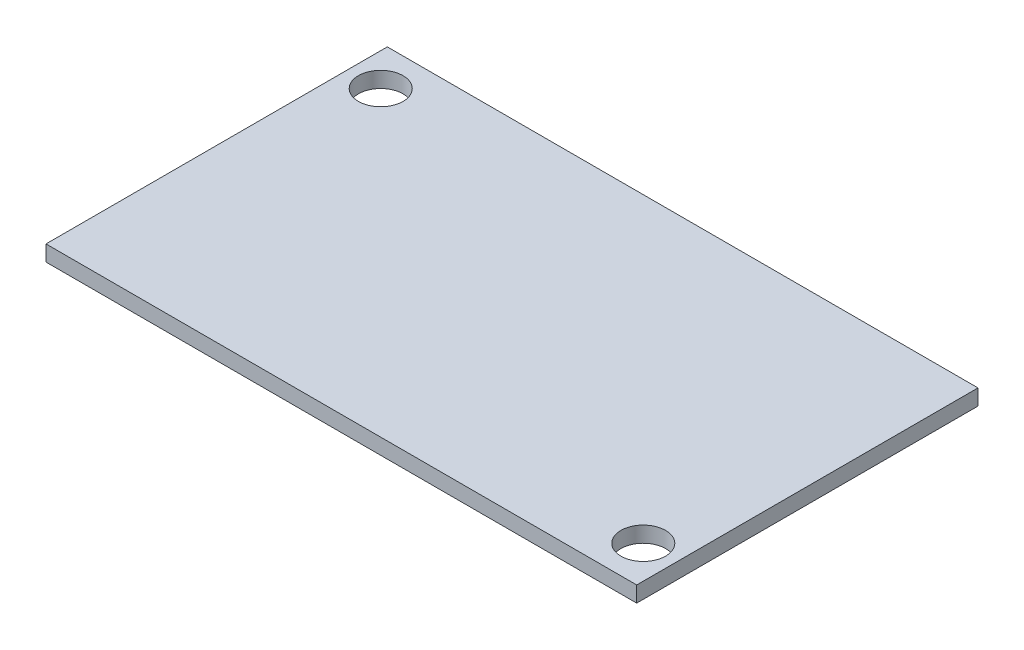
ISO-10303-21;
HEADER;
FILE_DESCRIPTION(('STEP AP214'),'2;1');
FILE_NAME('part.step','',(''),(''),'','','');
FILE_SCHEMA(('AUTOMOTIVE_DESIGN { 1 0 10303 214 1 1 1 1 }'));
ENDSEC;
DATA;
#1=APPLICATION_CONTEXT('core data for automotive mechanical design processes');
#2=APPLICATION_PROTOCOL_DEFINITION('international standard','automotive_design',2000,#1);
#3=PRODUCT_CONTEXT('',#1,'mechanical');
#4=PRODUCT('Part','Part','',(#3));
#5=PRODUCT_RELATED_PRODUCT_CATEGORY('part','',(#4));
#6=PRODUCT_DEFINITION_FORMATION('','',#4);
#7=PRODUCT_DEFINITION_CONTEXT('part definition',#1,'design');
#8=PRODUCT_DEFINITION('design','',#6,#7);
#9=PRODUCT_DEFINITION_SHAPE('','',#8);
#10=(LENGTH_UNIT() NAMED_UNIT(*) SI_UNIT(.MILLI.,.METRE.));
#11=(NAMED_UNIT(*) PLANE_ANGLE_UNIT() SI_UNIT($,.RADIAN.));
#12=(NAMED_UNIT(*) SI_UNIT($,.STERADIAN.) SOLID_ANGLE_UNIT());
#13=UNCERTAINTY_MEASURE_WITH_UNIT(LENGTH_MEASURE(1.E-05),#10,'distance_accuracy_value','');
#14=(GEOMETRIC_REPRESENTATION_CONTEXT(3) GLOBAL_UNCERTAINTY_ASSIGNED_CONTEXT((#13)) GLOBAL_UNIT_ASSIGNED_CONTEXT((#10,
#11,#12)) REPRESENTATION_CONTEXT('',''));
#15=CARTESIAN_POINT('',(0.,0.,0.));
#16=DIRECTION('',(0.,0.,1.));
#17=DIRECTION('',(1.,0.,0.));
#18=AXIS2_PLACEMENT_3D('',#15,#16,#17);
#19=CARTESIAN_POINT('',(-24.7774917250496,1.2,-1.35864833937372));
#20=DIRECTION('',(1.,0.,0.));
#21=DIRECTION('',(0.,0.,-1.));
#22=AXIS2_PLACEMENT_3D('',#19,#20,#21);
#23=PLANE('',#22);
#24=DIRECTION('',(0.,0.,1.));
#25=VECTOR('',#24,1.);
#26=CARTESIAN_POINT('',(-24.7774917250496,0.,-1.35864833937372));
#27=LINE('',#26,#25);
#28=CARTESIAN_POINT('',(-24.7774917250496,0.,-1.35864833937372));
#29=VERTEX_POINT('',#28);
#30=CARTESIAN_POINT('',(-24.7774917250496,0.,24.6413516606263));
#31=VERTEX_POINT('',#30);
#32=EDGE_CURVE('E95',#29,#31,#27,.T.);
#33=ORIENTED_EDGE('',*,*,#32,.T.);
#34=DIRECTION('',(0.,-1.,0.));
#35=VECTOR('',#34,1.);
#36=CARTESIAN_POINT('',(-24.7774917250496,1.2,24.6413516606263));
#37=LINE('',#36,#35);
#38=CARTESIAN_POINT('',(-24.7774917250496,1.2,24.6413516606263));
#39=VERTEX_POINT('',#38);
#40=EDGE_CURVE('E11',#39,#31,#37,.T.);
#41=ORIENTED_EDGE('',*,*,#40,.F.);
#42=DIRECTION('',(0.,0.,1.));
#43=VECTOR('',#42,1.);
#44=CARTESIAN_POINT('',(-24.7774917250496,1.2,-1.35864833937372));
#45=LINE('',#44,#43);
#46=CARTESIAN_POINT('',(-24.7774917250496,1.2,-1.35864833937372));
#47=VERTEX_POINT('',#46);
#48=EDGE_CURVE('E83',#47,#39,#45,.T.);
#49=ORIENTED_EDGE('',*,*,#48,.F.);
#50=DIRECTION('',(0.,-1.,0.));
#51=VECTOR('',#50,1.);
#52=CARTESIAN_POINT('',(-24.7774917250496,1.2,-1.35864833937372));
#53=LINE('',#52,#51);
#54=EDGE_CURVE('E91',#47,#29,#53,.T.);
#55=ORIENTED_EDGE('',*,*,#54,.T.);
#56=EDGE_LOOP('',(#33,#41,#49,#55));
#57=FACE_BOUND('',#56,.T.);
#58=ADVANCED_FACE('F32',(#57),#23,.F.);
#59=CARTESIAN_POINT('',(-24.7774917250496,1.2,24.6413516606263));
#60=DIRECTION('',(0.,0.,-1.));
#61=DIRECTION('',(-1.,0.,0.));
#62=AXIS2_PLACEMENT_3D('',#59,#60,#61);
#63=PLANE('',#62);
#64=DIRECTION('',(1.,0.,0.));
#65=VECTOR('',#64,1.);
#66=CARTESIAN_POINT('',(-24.7774917250496,0.,24.6413516606263));
#67=LINE('',#66,#65);
#68=CARTESIAN_POINT('',(20.2225082749504,0.,24.6413516606263));
#69=VERTEX_POINT('',#68);
#70=EDGE_CURVE('E87',#31,#69,#67,.T.);
#71=ORIENTED_EDGE('',*,*,#70,.T.);
#72=DIRECTION('',(0.,-1.,0.));
#73=VECTOR('',#72,1.);
#74=CARTESIAN_POINT('',(20.2225082749504,1.2,24.6413516606263));
#75=LINE('',#74,#73);
#76=CARTESIAN_POINT('',(20.2225082749504,1.2,24.6413516606263));
#77=VERTEX_POINT('',#76);
#78=EDGE_CURVE('E40',#77,#69,#75,.T.);
#79=ORIENTED_EDGE('',*,*,#78,.F.);
#80=DIRECTION('',(1.,0.,0.));
#81=VECTOR('',#80,1.);
#82=CARTESIAN_POINT('',(-24.7774917250496,1.2,24.6413516606263));
#83=LINE('',#82,#81);
#84=EDGE_CURVE('E78',#39,#77,#83,.T.);
#85=ORIENTED_EDGE('',*,*,#84,.F.);
#86=ORIENTED_EDGE('',*,*,#40,.T.);
#87=EDGE_LOOP('',(#71,#79,#85,#86));
#88=FACE_BOUND('',#87,.T.);
#89=ADVANCED_FACE('F86',(#88),#63,.F.);
#90=CARTESIAN_POINT('',(20.2225082749504,1.2,-1.35864833937372));
#91=DIRECTION('',(-1.,0.,0.));
#92=DIRECTION('',(0.,0.,1.));
#93=AXIS2_PLACEMENT_3D('',#90,#91,#92);
#94=PLANE('',#93);
#95=DIRECTION('',(0.,0.,-1.));
#96=VECTOR('',#95,1.);
#97=CARTESIAN_POINT('',(20.2225082749504,0.,-1.35864833937372));
#98=LINE('',#97,#96);
#99=CARTESIAN_POINT('',(20.2225082749504,0.,-1.35864833937372));
#100=VERTEX_POINT('',#99);
#101=EDGE_CURVE('E65',#69,#100,#98,.T.);
#102=ORIENTED_EDGE('',*,*,#101,.T.);
#103=DIRECTION('',(0.,-1.,0.));
#104=VECTOR('',#103,1.);
#105=CARTESIAN_POINT('',(20.2225082749504,1.2,-1.35864833937372));
#106=LINE('',#105,#104);
#107=CARTESIAN_POINT('',(20.2225082749504,1.2,-1.35864833937372));
#108=VERTEX_POINT('',#107);
#109=EDGE_CURVE('E88',#108,#100,#106,.T.);
#110=ORIENTED_EDGE('',*,*,#109,.F.);
#111=DIRECTION('',(0.,0.,-1.));
#112=VECTOR('',#111,1.);
#113=CARTESIAN_POINT('',(20.2225082749504,1.2,-1.35864833937372));
#114=LINE('',#113,#112);
#115=EDGE_CURVE('E81',#77,#108,#114,.T.);
#116=ORIENTED_EDGE('',*,*,#115,.F.);
#117=ORIENTED_EDGE('',*,*,#78,.T.);
#118=EDGE_LOOP('',(#102,#110,#116,#117));
#119=FACE_BOUND('',#118,.T.);
#120=ADVANCED_FACE('F89',(#119),#94,.F.);
#121=CARTESIAN_POINT('',(-24.7774917250496,1.2,-1.35864833937372));
#122=DIRECTION('',(0.,0.,1.));
#123=DIRECTION('',(1.,0.,0.));
#124=AXIS2_PLACEMENT_3D('',#121,#122,#123);
#125=PLANE('',#124);
#126=DIRECTION('',(-1.,0.,0.));
#127=VECTOR('',#126,1.);
#128=CARTESIAN_POINT('',(-24.7774917250496,0.,-1.35864833937372));
#129=LINE('',#128,#127);
#130=EDGE_CURVE('E71',#100,#29,#129,.T.);
#131=ORIENTED_EDGE('',*,*,#130,.T.);
#132=ORIENTED_EDGE('',*,*,#54,.F.);
#133=DIRECTION('',(-1.,0.,0.));
#134=VECTOR('',#133,1.);
#135=CARTESIAN_POINT('',(-24.7774917250496,1.2,-1.35864833937372));
#136=LINE('',#135,#134);
#137=EDGE_CURVE('E48',#108,#47,#136,.T.);
#138=ORIENTED_EDGE('',*,*,#137,.F.);
#139=ORIENTED_EDGE('',*,*,#109,.T.);
#140=EDGE_LOOP('',(#131,#132,#138,#139));
#141=FACE_BOUND('',#140,.T.);
#142=ADVANCED_FACE('F103',(#141),#125,.F.);
#143=CARTESIAN_POINT('',(0.,1.2,0.));
#144=DIRECTION('',(0.,1.,0.));
#145=DIRECTION('',(0.,0.,1.));
#146=AXIS2_PLACEMENT_3D('',#143,#144,#145);
#147=PLANE('',#146);
#148=CARTESIAN_POINT('',(-22.2774917250496,1.2,1.64135166062628));
#149=DIRECTION('',(0.,1.,0.));
#150=DIRECTION('',(0.,0.,1.));
#151=AXIS2_PLACEMENT_3D('',#148,#149,#150);
#152=CIRCLE('',#151,1.69999999999999);
#153=CARTESIAN_POINT('',(-22.2774917250496,1.2,3.34135166062627));
#154=VERTEX_POINT('',#153);
#155=EDGE_CURVE('E117',#154,#154,#152,.T.);
#156=ORIENTED_EDGE('',*,*,#155,.F.);
#157=EDGE_LOOP('',(#156));
#158=FACE_BOUND('',#157,.T.);
#159=CARTESIAN_POINT('',(17.7225082749504,1.2,21.6413516606263));
#160=DIRECTION('',(0.,1.,0.));
#161=DIRECTION('',(0.,0.,1.));
#162=AXIS2_PLACEMENT_3D('',#159,#160,#161);
#163=CIRCLE('',#162,1.69999999999999);
#164=CARTESIAN_POINT('',(17.7225082749504,1.2,23.3413516606263));
#165=VERTEX_POINT('',#164);
#166=EDGE_CURVE('E111',#165,#165,#163,.T.);
#167=ORIENTED_EDGE('',*,*,#166,.F.);
#168=EDGE_LOOP('',(#167));
#169=FACE_BOUND('',#168,.T.);
#170=ORIENTED_EDGE('',*,*,#48,.T.);
#171=ORIENTED_EDGE('',*,*,#84,.T.);
#172=ORIENTED_EDGE('',*,*,#115,.T.);
#173=ORIENTED_EDGE('',*,*,#137,.T.);
#174=EDGE_LOOP('',(#170,#171,#172,#173));
#175=FACE_BOUND('',#174,.T.);
#176=ADVANCED_FACE('F79',(#158,#169,#175),#147,.T.);
#177=CARTESIAN_POINT('',(0.,0.,0.));
#178=DIRECTION('',(0.,1.,0.));
#179=DIRECTION('',(0.,0.,1.));
#180=AXIS2_PLACEMENT_3D('',#177,#178,#179);
#181=PLANE('',#180);
#182=CARTESIAN_POINT('',(-22.2774917250496,0.,1.64135166062628));
#183=DIRECTION('',(0.,1.,0.));
#184=DIRECTION('',(0.,0.,1.));
#185=AXIS2_PLACEMENT_3D('',#182,#183,#184);
#186=CIRCLE('',#185,1.7);
#187=CARTESIAN_POINT('',(-22.2774917250496,0.,3.34135166062628));
#188=VERTEX_POINT('',#187);
#189=EDGE_CURVE('E114',#188,#188,#186,.T.);
#190=ORIENTED_EDGE('',*,*,#189,.T.);
#191=EDGE_LOOP('',(#190));
#192=FACE_BOUND('',#191,.T.);
#193=CARTESIAN_POINT('',(17.7225082749504,0.,21.6413516606263));
#194=DIRECTION('',(0.,1.,0.));
#195=DIRECTION('',(0.,0.,1.));
#196=AXIS2_PLACEMENT_3D('',#193,#194,#195);
#197=CIRCLE('',#196,1.7);
#198=CARTESIAN_POINT('',(17.7225082749504,0.,23.3413516606263));
#199=VERTEX_POINT('',#198);
#200=EDGE_CURVE('E98',#199,#199,#197,.T.);
#201=ORIENTED_EDGE('',*,*,#200,.T.);
#202=EDGE_LOOP('',(#201));
#203=FACE_BOUND('',#202,.T.);
#204=ORIENTED_EDGE('',*,*,#32,.F.);
#205=ORIENTED_EDGE('',*,*,#130,.F.);
#206=ORIENTED_EDGE('',*,*,#101,.F.);
#207=ORIENTED_EDGE('',*,*,#70,.F.);
#208=EDGE_LOOP('',(#204,#205,#206,#207));
#209=FACE_BOUND('',#208,.T.);
#210=ADVANCED_FACE('F106',(#192,#203,#209),#181,.F.);
#211=CARTESIAN_POINT('',(17.7225082749504,1.2,21.6413516606263));
#212=DIRECTION('',(0.,1.,0.));
#213=DIRECTION('',(0.,0.,1.));
#214=AXIS2_PLACEMENT_3D('',#211,#212,#213);
#215=CYLINDRICAL_SURFACE('',#214,1.69999999999999);
#216=ORIENTED_EDGE('',*,*,#200,.F.);
#217=EDGE_LOOP('',(#216));
#218=FACE_BOUND('',#217,.T.);
#219=ORIENTED_EDGE('',*,*,#166,.T.);
#220=EDGE_LOOP('',(#219));
#221=FACE_BOUND('',#220,.T.);
#222=ADVANCED_FACE('F128',(#218,#221),#215,.F.);
#223=CARTESIAN_POINT('',(-22.2774917250496,1.2,1.64135166062628));
#224=DIRECTION('',(0.,1.,0.));
#225=DIRECTION('',(0.,0.,1.));
#226=AXIS2_PLACEMENT_3D('',#223,#224,#225);
#227=CYLINDRICAL_SURFACE('',#226,1.69999999999999);
#228=ORIENTED_EDGE('',*,*,#189,.F.);
#229=EDGE_LOOP('',(#228));
#230=FACE_BOUND('',#229,.T.);
#231=ORIENTED_EDGE('',*,*,#155,.T.);
#232=EDGE_LOOP('',(#231));
#233=FACE_BOUND('',#232,.T.);
#234=ADVANCED_FACE('F121',(#230,#233),#227,.F.);
#235=CLOSED_SHELL('',(#58,#89,#120,#142,#176,#210,#222,#234));
#236=MANIFOLD_SOLID_BREP('B2',#235);
#237=ADVANCED_BREP_SHAPE_REPRESENTATION('',(#18,#236),#14);
#238=SHAPE_DEFINITION_REPRESENTATION(#9,#237);
ENDSEC;
END-ISO-10303-21;
